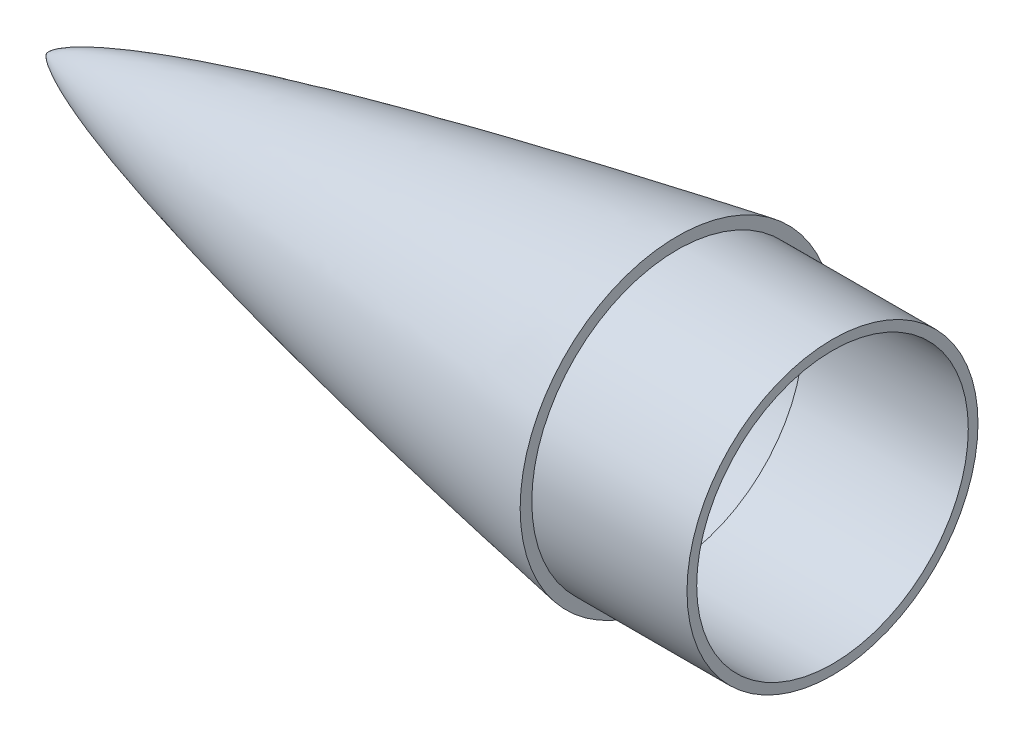
ISO-10303-21;
HEADER;
FILE_DESCRIPTION(('STEP AP214'),'2;1');
FILE_NAME('part.step','',(''),(''),'','','');
FILE_SCHEMA(('AUTOMOTIVE_DESIGN { 1 0 10303 214 1 1 1 1 }'));
ENDSEC;
DATA;
#1=APPLICATION_CONTEXT('core data for automotive mechanical design processes');
#2=APPLICATION_PROTOCOL_DEFINITION('international standard','automotive_design',2000,#1);
#3=PRODUCT_CONTEXT('',#1,'mechanical');
#4=PRODUCT('Part','Part','',(#3));
#5=PRODUCT_RELATED_PRODUCT_CATEGORY('part','',(#4));
#6=PRODUCT_DEFINITION_FORMATION('','',#4);
#7=PRODUCT_DEFINITION_CONTEXT('part definition',#1,'design');
#8=PRODUCT_DEFINITION('design','',#6,#7);
#9=PRODUCT_DEFINITION_SHAPE('','',#8);
#10=(LENGTH_UNIT() NAMED_UNIT(*) SI_UNIT(.MILLI.,.METRE.));
#11=(NAMED_UNIT(*) PLANE_ANGLE_UNIT() SI_UNIT($,.RADIAN.));
#12=(NAMED_UNIT(*) SI_UNIT($,.STERADIAN.) SOLID_ANGLE_UNIT());
#13=UNCERTAINTY_MEASURE_WITH_UNIT(LENGTH_MEASURE(1.E-05),#10,'distance_accuracy_value','');
#14=(GEOMETRIC_REPRESENTATION_CONTEXT(3) GLOBAL_UNCERTAINTY_ASSIGNED_CONTEXT((#13)) GLOBAL_UNIT_ASSIGNED_CONTEXT((#10,
#11,#12)) REPRESENTATION_CONTEXT('',''));
#15=CARTESIAN_POINT('',(0.,0.,0.));
#16=DIRECTION('',(0.,0.,1.));
#17=DIRECTION('',(1.,0.,0.));
#18=AXIS2_PLACEMENT_3D('',#15,#16,#17);
#19=CARTESIAN_POINT('',(165.1,0.,-41.148));
#20=CARTESIAN_POINT('',(163.640225229088,0.,-40.8933254476594));
#21=CARTESIAN_POINT('',(160.717658024187,0.,-40.381278125316));
#22=CARTESIAN_POINT('',(155.816374852835,0.,-39.5179145461964));
#23=CARTESIAN_POINT('',(151.741312916226,0.,-38.7882540101992));
#24=CARTESIAN_POINT('',(147.330015649565,0.,-37.9969554138867));
#25=CARTESIAN_POINT('',(144.373798160244,0.,-37.4600911074701));
#26=CARTESIAN_POINT('',(141.01365704239,0.,-36.8488920625775));
#27=CARTESIAN_POINT('',(137.910069361311,0.,-36.278471928051));
#28=CARTESIAN_POINT('',(134.653494547204,0.,-35.6772680621597));
#29=CARTESIAN_POINT('',(131.484707509867,0.,-35.0871559482819));
#30=CARTESIAN_POINT('',(127.47100067012,0.,-34.3348865184878));
#31=CARTESIAN_POINT('',(122.684721912743,0.,-33.428437780141));
#32=CARTESIAN_POINT('',(117.08630963054,0.,-32.3546875124702));
#33=CARTESIAN_POINT('',(110.701519074695,0.,-31.109714448242));
#34=CARTESIAN_POINT('',(102.720362156903,0.,-29.5264876336595));
#35=CARTESIAN_POINT('',(93.1547363463019,0.,-27.5819943681558));
#36=CARTESIAN_POINT('',(82.0082924847931,0.,-25.2395014083218));
#37=CARTESIAN_POINT('',(69.2965089642764,0.,-22.4415730130242));
#38=CARTESIAN_POINT('',(56.6175317303704,0.,-19.4951864802619));
#39=CARTESIAN_POINT('',(43.9844058392101,0.,-16.3587704831985));
#40=CARTESIAN_POINT('',(31.8592035697645,0.,-13.0859197958654));
#41=CARTESIAN_POINT('',(21.4410767603449,0.,-9.94902625945067));
#42=CARTESIAN_POINT('',(13.3082135744179,0.,-7.14453932527941));
#43=CARTESIAN_POINT('',(7.81438643414991,0.,-4.91869063180792));
#44=CARTESIAN_POINT('',(4.66392342479072,0.,-3.42657959657714));
#45=CARTESIAN_POINT('',(2.80025699214947,0.,-2.39612382066436));
#46=CARTESIAN_POINT('',(1.71003806278854,0.,-1.69538077587282));
#47=CARTESIAN_POINT('',(1.06014225367872,0.,-1.21252891893654));
#48=CARTESIAN_POINT('',(0.665702147756695,0.,-0.875192262942684));
#49=CARTESIAN_POINT('',(0.419021595092745,0.,-0.633007013923358));
#50=CARTESIAN_POINT('',(0.264707078117077,0.,-0.458998446074888));
#51=CARTESIAN_POINT('',(0.161852156025567,0.,-0.325817466446624));
#52=CARTESIAN_POINT('',(0.0922874495062912,0.,-0.220937640001151));
#53=CARTESIAN_POINT('',(0.0478669581009387,0.,-0.141172459612112));
#54=CARTESIAN_POINT('',(0.0185353965605564,0.,-0.0742525869317578));
#55=CARTESIAN_POINT('',(0.00517297735475036,0.,-0.03242016287217));
#56=CARTESIAN_POINT('',(0.0012673794072738,0.,-0.0109048647506091));
#57=CARTESIAN_POINT('',(0.,0.,0.));
#58=B_SPLINE_CURVE_WITH_KNOTS('',4,(#19,#20,#21,#22,#23,#24,#25,#26,#27,#28,#29,#30,#31,#32,#33,
#34,#35,#36,#37,#38,#39,#40,#41,#42,#43,#44,#45,#46,#47,#48,#49,#50,#51,#52,#53,#54,#55,#56,
#57),.UNSPECIFIED.,.F.,.F.,(5,1,1,1,1,1,1,1,1,1,1,1,1,1,1,1,1,1,1,1,1,1,1,1,1,1,1,1,1,1,1,1,1,1,
1,5),(0.,0.0346703561448937,0.0693407122897873,0.0866758905772772,0.104011068864767,
0.121346247152257,0.138681425439747,0.156016603885988,0.17335178233223,0.190686960778471,
0.208022139224712,0.24269249610726,0.277362852989807,0.312033209565514,0.34670356614122,
0.416044279276319,0.48538499069287,0.554725702200457,0.624066414607376,0.693407125314698,
0.76274783243079,0.82231987846975,0.855869986490771,0.876652649616592,0.889000160494225,
0.896558731687207,0.901219304787302,0.904249054054836,0.906240194899474,0.907609913656757,
0.908580245120005,0.90920115782465,0.909823226605379,0.910289643799139,0.910522852396019,
0.910756060992899),.UNSPECIFIED.);
#59=CARTESIAN_POINT('',(0.,0.,0.));
#60=DIRECTION('',(-1.,0.,0.));
#61=AXIS1_PLACEMENT('',#59,#60);
#62=SURFACE_OF_REVOLUTION('',#58,#61);
#63=CARTESIAN_POINT('',(0.,0.,0.));
#64=VERTEX_POINT('',#63);
#65=VERTEX_LOOP('',#64);
#66=FACE_BOUND('',#65,.T.);
#67=CARTESIAN_POINT('',(165.1,0.,0.));
#68=DIRECTION('',(-1.,0.,0.));
#69=DIRECTION('',(0.,0.,1.));
#70=AXIS2_PLACEMENT_3D('',#67,#68,#69);
#71=CIRCLE('',#70,41.148);
#72=CARTESIAN_POINT('',(165.1,0.,41.148));
#73=VERTEX_POINT('',#72);
#74=EDGE_CURVE('E53',#73,#73,#71,.T.);
#75=ORIENTED_EDGE('',*,*,#74,.T.);
#76=EDGE_LOOP('',(#75));
#77=FACE_BOUND('',#76,.T.);
#78=ADVANCED_FACE('F45',(#66,#77),#62,.T.);
#79=CARTESIAN_POINT('',(165.1,0.,0.));
#80=DIRECTION('',(-1.,0.,0.));
#81=DIRECTION('',(0.,0.,1.));
#82=AXIS2_PLACEMENT_3D('',#79,#80,#81);
#83=PLANE('',#82);
#84=CARTESIAN_POINT('',(165.1,0.,0.));
#85=DIRECTION('',(-1.,0.,0.));
#86=DIRECTION('',(0.,0.,1.));
#87=AXIS2_PLACEMENT_3D('',#84,#85,#86);
#88=CIRCLE('',#87,38.1);
#89=CARTESIAN_POINT('',(165.1,0.,38.1));
#90=VERTEX_POINT('',#89);
#91=EDGE_CURVE('E11',#90,#90,#88,.F.);
#92=ORIENTED_EDGE('',*,*,#91,.F.);
#93=EDGE_LOOP('',(#92));
#94=FACE_BOUND('',#93,.T.);
#95=ORIENTED_EDGE('',*,*,#74,.F.);
#96=EDGE_LOOP('',(#95));
#97=FACE_BOUND('',#96,.T.);
#98=ADVANCED_FACE('F100',(#94,#97),#83,.F.);
#99=CARTESIAN_POINT('',(205.74,0.,0.));
#100=DIRECTION('',(-1.,0.,0.));
#101=DIRECTION('',(0.,0.,1.));
#102=AXIS2_PLACEMENT_3D('',#99,#100,#101);
#103=CYLINDRICAL_SURFACE('',#102,38.1);
#104=CARTESIAN_POINT('',(205.74,0.,0.));
#105=DIRECTION('',(1.,0.,0.));
#106=DIRECTION('',(0.,0.,-1.));
#107=AXIS2_PLACEMENT_3D('',#104,#105,#106);
#108=CIRCLE('',#107,38.1);
#109=CARTESIAN_POINT('',(205.74,0.,-38.1));
#110=VERTEX_POINT('',#109);
#111=EDGE_CURVE('E73',#110,#110,#108,.T.);
#112=ORIENTED_EDGE('',*,*,#111,.F.);
#113=EDGE_LOOP('',(#112));
#114=FACE_BOUND('',#113,.T.);
#115=ORIENTED_EDGE('',*,*,#91,.T.);
#116=EDGE_LOOP('',(#115));
#117=FACE_BOUND('',#116,.T.);
#118=ADVANCED_FACE('F97',(#114,#117),#103,.T.);
#119=CARTESIAN_POINT('',(205.74,0.,0.));
#120=DIRECTION('',(1.,0.,0.));
#121=DIRECTION('',(0.,0.,-1.));
#122=AXIS2_PLACEMENT_3D('',#119,#120,#121);
#123=PLANE('',#122);
#124=CARTESIAN_POINT('',(205.74,0.,0.));
#125=DIRECTION('',(1.,0.,0.));
#126=DIRECTION('',(0.,0.,-1.));
#127=AXIS2_PLACEMENT_3D('',#124,#125,#126);
#128=CIRCLE('',#127,35.56);
#129=CARTESIAN_POINT('',(205.74,0.,-35.56));
#130=VERTEX_POINT('',#129);
#131=EDGE_CURVE('E70',#130,#130,#128,.T.);
#132=ORIENTED_EDGE('',*,*,#131,.F.);
#133=EDGE_LOOP('',(#132));
#134=FACE_BOUND('',#133,.T.);
#135=ORIENTED_EDGE('',*,*,#111,.T.);
#136=EDGE_LOOP('',(#135));
#137=FACE_BOUND('',#136,.T.);
#138=ADVANCED_FACE('F63',(#134,#137),#123,.T.);
#139=CARTESIAN_POINT('',(165.1,0.,-41.148));
#140=CARTESIAN_POINT('',(163.640225229088,0.,-40.8933254476594));
#141=CARTESIAN_POINT('',(160.717658024187,0.,-40.381278125316));
#142=CARTESIAN_POINT('',(155.816374852835,0.,-39.5179145461964));
#143=CARTESIAN_POINT('',(151.741312916226,0.,-38.7882540101992));
#144=CARTESIAN_POINT('',(147.330015649565,0.,-37.9969554138867));
#145=CARTESIAN_POINT('',(144.373798160244,0.,-37.4600911074701));
#146=CARTESIAN_POINT('',(141.01365704239,0.,-36.8488920625775));
#147=CARTESIAN_POINT('',(137.910069361311,0.,-36.278471928051));
#148=CARTESIAN_POINT('',(134.653494547204,0.,-35.6772680621597));
#149=CARTESIAN_POINT('',(131.484707509867,0.,-35.0871559482819));
#150=CARTESIAN_POINT('',(127.47100067012,0.,-34.3348865184878));
#151=CARTESIAN_POINT('',(122.684721912743,0.,-33.428437780141));
#152=CARTESIAN_POINT('',(117.08630963054,0.,-32.3546875124702));
#153=CARTESIAN_POINT('',(110.701519074695,0.,-31.109714448242));
#154=CARTESIAN_POINT('',(102.720362156903,0.,-29.5264876336595));
#155=CARTESIAN_POINT('',(93.1547363463019,0.,-27.5819943681558));
#156=CARTESIAN_POINT('',(82.0082924847931,0.,-25.2395014083218));
#157=CARTESIAN_POINT('',(69.2965089642764,0.,-22.4415730130242));
#158=CARTESIAN_POINT('',(56.6175317303704,0.,-19.4951864802619));
#159=CARTESIAN_POINT('',(43.9844058392101,0.,-16.3587704831985));
#160=CARTESIAN_POINT('',(31.8592035697645,0.,-13.0859197958654));
#161=CARTESIAN_POINT('',(21.4410767603449,0.,-9.94902625945067));
#162=CARTESIAN_POINT('',(13.3082135744179,0.,-7.14453932527941));
#163=CARTESIAN_POINT('',(7.81438643414991,0.,-4.91869063180792));
#164=CARTESIAN_POINT('',(4.81154421958937,0.,-3.49649523002349));
#165=CARTESIAN_POINT('',(3.27809741849169,0.,-2.65932982993859));
#166=CARTESIAN_POINT('',(2.61708126028551,0.,-2.26249461429979));
#167=CARTESIAN_POINT('',(2.45410614502108,0.,-2.16199720744023));
#168=B_SPLINE_CURVE_WITH_KNOTS('',4,(#139,#140,#141,#142,#143,#144,#145,#146,#147,#148,#149,
#150,#151,#152,#153,#154,#155,#156,#157,#158,#159,#160,#161,#162,#163,#164,#165,#166,#167),
.UNSPECIFIED.,.F.,.F.,(5,1,1,1,1,1,1,1,1,1,1,1,1,1,1,1,1,1,1,1,1,1,1,1,1,5),(0.,
0.0346703561448937,0.0693407122897873,0.0866758905772772,0.104011068864767,0.121346247152257,
0.138681425439747,0.156016603885988,0.17335178233223,0.190686960778471,0.208022139224712,
0.24269249610726,0.277362852989807,0.312033209565514,0.34670356614122,0.416044279276319,
0.48538499069287,0.554725702200457,0.624066414607376,0.693407125314698,0.76274783243079,
0.82231987846975,0.855869986490771,0.876652649616592,0.889000160494225,0.893080132356142),.UNSPECIFIED.);
#169=CARTESIAN_POINT('',(0.,0.,0.));
#170=DIRECTION('',(-1.,0.,0.));
#171=AXIS1_PLACEMENT('',#169,#170);
#172=SURFACE_OF_REVOLUTION('',#168,#171);
#173=OFFSET_SURFACE('',#172,-2.54,.F.);
#174=CARTESIAN_POINT('',(3.78728583096765,0.,0.));
#175=VERTEX_POINT('',#174);
#176=VERTEX_LOOP('',#175);
#177=FACE_BOUND('',#176,.T.);
#178=CARTESIAN_POINT('',(162.56,0.,0.));
#179=DIRECTION('',(-1.,0.,0.));
#180=DIRECTION('',(0.,0.,1.));
#181=AXIS2_PLACEMENT_3D('',#178,#179,#180);
#182=CIRCLE('',#181,38.1248987934584);
#183=CARTESIAN_POINT('',(162.56,0.,38.1248987934584));
#184=VERTEX_POINT('',#183);
#185=EDGE_CURVE('E67',#184,#184,#182,.T.);
#186=ORIENTED_EDGE('',*,*,#185,.F.);
#187=EDGE_LOOP('',(#186));
#188=FACE_BOUND('',#187,.T.);
#189=ADVANCED_FACE('F59',(#177,#188),#173,.F.);
#190=CARTESIAN_POINT('',(162.56,0.,0.));
#191=DIRECTION('',(-1.,0.,0.));
#192=DIRECTION('',(0.,0.,1.));
#193=AXIS2_PLACEMENT_3D('',#190,#191,#192);
#194=PLANE('',#193);
#195=CARTESIAN_POINT('',(162.56,0.,0.));
#196=DIRECTION('',(-1.,0.,0.));
#197=DIRECTION('',(0.,0.,1.));
#198=AXIS2_PLACEMENT_3D('',#195,#196,#197);
#199=CIRCLE('',#198,35.56);
#200=CARTESIAN_POINT('',(162.56,0.,35.56));
#201=VERTEX_POINT('',#200);
#202=EDGE_CURVE('E69',#201,#201,#199,.F.);
#203=ORIENTED_EDGE('',*,*,#202,.T.);
#204=EDGE_LOOP('',(#203));
#205=FACE_BOUND('',#204,.T.);
#206=ORIENTED_EDGE('',*,*,#185,.T.);
#207=EDGE_LOOP('',(#206));
#208=FACE_BOUND('',#207,.T.);
#209=ADVANCED_FACE('F62',(#205,#208),#194,.T.);
#210=CARTESIAN_POINT('',(205.74,0.,0.));
#211=DIRECTION('',(-1.,0.,0.));
#212=DIRECTION('',(0.,0.,1.));
#213=AXIS2_PLACEMENT_3D('',#210,#211,#212);
#214=CYLINDRICAL_SURFACE('',#213,35.56);
#215=ORIENTED_EDGE('',*,*,#131,.T.);
#216=EDGE_LOOP('',(#215));
#217=FACE_BOUND('',#216,.T.);
#218=ORIENTED_EDGE('',*,*,#202,.F.);
#219=EDGE_LOOP('',(#218));
#220=FACE_BOUND('',#219,.T.);
#221=ADVANCED_FACE('F90',(#217,#220),#214,.F.);
#222=CLOSED_SHELL('',(#78,#98,#118,#138,#189,#209,#221));
#223=MANIFOLD_SOLID_BREP('B2',#222);
#224=ADVANCED_BREP_SHAPE_REPRESENTATION('',(#18,#223),#14);
#225=SHAPE_DEFINITION_REPRESENTATION(#9,#224);
ENDSEC;
END-ISO-10303-21;
